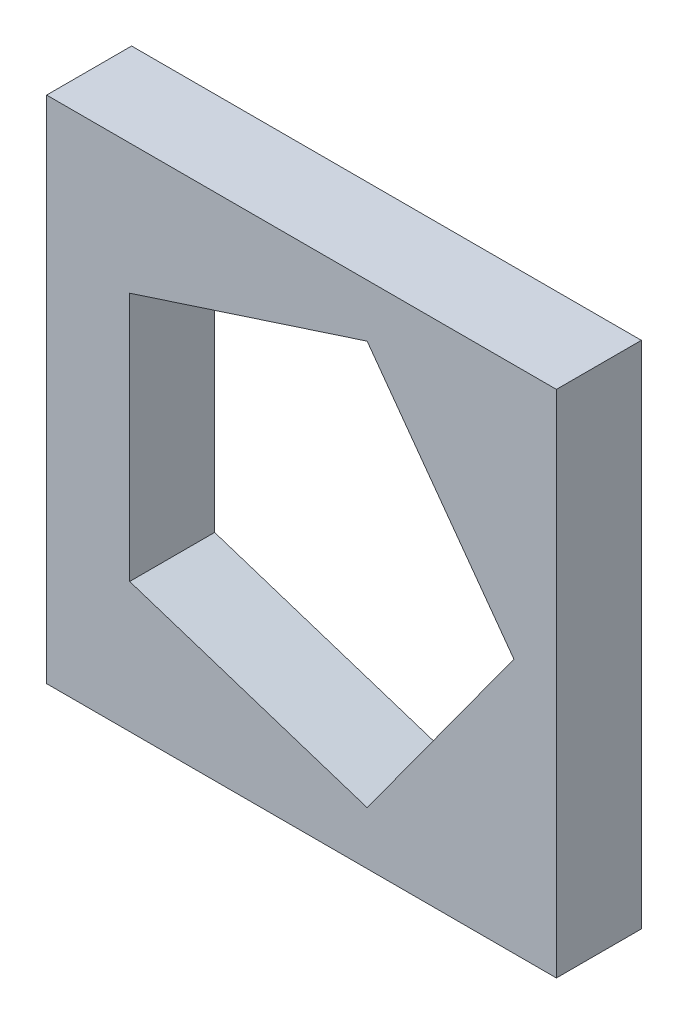
ISO-10303-21;
HEADER;
FILE_DESCRIPTION(('STEP AP214'),'2;1');
FILE_NAME('part.step','',(''),(''),'','','');
FILE_SCHEMA(('AUTOMOTIVE_DESIGN { 1 0 10303 214 1 1 1 1 }'));
ENDSEC;
DATA;
#1=APPLICATION_CONTEXT('core data for automotive mechanical design processes');
#2=APPLICATION_PROTOCOL_DEFINITION('international standard','automotive_design',2000,#1);
#3=PRODUCT_CONTEXT('',#1,'mechanical');
#4=PRODUCT('Part','Part','',(#3));
#5=PRODUCT_RELATED_PRODUCT_CATEGORY('part','',(#4));
#6=PRODUCT_DEFINITION_FORMATION('','',#4);
#7=PRODUCT_DEFINITION_CONTEXT('part definition',#1,'design');
#8=PRODUCT_DEFINITION('design','',#6,#7);
#9=PRODUCT_DEFINITION_SHAPE('','',#8);
#10=(LENGTH_UNIT() NAMED_UNIT(*) SI_UNIT(.MILLI.,.METRE.));
#11=(NAMED_UNIT(*) PLANE_ANGLE_UNIT() SI_UNIT($,.RADIAN.));
#12=(NAMED_UNIT(*) SI_UNIT($,.STERADIAN.) SOLID_ANGLE_UNIT());
#13=UNCERTAINTY_MEASURE_WITH_UNIT(LENGTH_MEASURE(1.E-05),#10,'distance_accuracy_value','');
#14=(GEOMETRIC_REPRESENTATION_CONTEXT(3) GLOBAL_UNCERTAINTY_ASSIGNED_CONTEXT((#13)) GLOBAL_UNIT_ASSIGNED_CONTEXT((#10,
#11,#12)) REPRESENTATION_CONTEXT('',''));
#15=CARTESIAN_POINT('',(0.,0.,0.));
#16=DIRECTION('',(0.,0.,1.));
#17=DIRECTION('',(1.,0.,0.));
#18=AXIS2_PLACEMENT_3D('',#15,#16,#17);
#19=CARTESIAN_POINT('',(0.,0.,10.));
#20=DIRECTION('',(0.,0.,1.));
#21=DIRECTION('',(1.,0.,0.));
#22=AXIS2_PLACEMENT_3D('',#19,#20,#21);
#23=PLANE('',#22);
#24=DIRECTION('',(0.,-1.,0.));
#25=VECTOR('',#24,1.);
#26=CARTESIAN_POINT('',(-30.,30.,10.));
#27=LINE('',#26,#25);
#28=CARTESIAN_POINT('',(-30.,30.,10.));
#29=VERTEX_POINT('',#28);
#30=CARTESIAN_POINT('',(-30.,-30.,10.));
#31=VERTEX_POINT('',#30);
#32=EDGE_CURVE('E175',#29,#31,#27,.T.);
#33=ORIENTED_EDGE('',*,*,#32,.T.);
#34=DIRECTION('',(1.,0.,0.));
#35=VECTOR('',#34,1.);
#36=CARTESIAN_POINT('',(-30.,-30.,10.));
#37=LINE('',#36,#35);
#38=CARTESIAN_POINT('',(30.,-30.,10.));
#39=VERTEX_POINT('',#38);
#40=EDGE_CURVE('E178',#31,#39,#37,.T.);
#41=ORIENTED_EDGE('',*,*,#40,.T.);
#42=DIRECTION('',(0.,-1.,0.));
#43=VECTOR('',#42,1.);
#44=CARTESIAN_POINT('',(30.,30.,10.));
#45=LINE('',#44,#43);
#46=CARTESIAN_POINT('',(30.,30.,10.));
#47=VERTEX_POINT('',#46);
#48=EDGE_CURVE('E181',#47,#39,#45,.T.);
#49=ORIENTED_EDGE('',*,*,#48,.F.);
#50=DIRECTION('',(1.,0.,0.));
#51=VECTOR('',#50,1.);
#52=CARTESIAN_POINT('',(-30.,30.,10.));
#53=LINE('',#52,#51);
#54=EDGE_CURVE('E184',#29,#47,#53,.T.);
#55=ORIENTED_EDGE('',*,*,#54,.F.);
#56=EDGE_LOOP('',(#33,#41,#49,#55));
#57=FACE_BOUND('',#56,.T.);
#58=DIRECTION('',(-0.587785252292473,0.809016994374947,0.));
#59=VECTOR('',#58,1.);
#60=CARTESIAN_POINT('',(25.,0.,10.));
#61=LINE('',#60,#59);
#62=CARTESIAN_POINT('',(25.,0.,10.));
#63=VERTEX_POINT('',#62);
#64=CARTESIAN_POINT('',(7.72542485937369,23.7764129073789,10.));
#65=VERTEX_POINT('',#64);
#66=EDGE_CURVE('E139',#63,#65,#61,.T.);
#67=ORIENTED_EDGE('',*,*,#66,.F.);
#68=DIRECTION('',(0.587785252292473,0.809016994374947,0.));
#69=VECTOR('',#68,1.);
#70=CARTESIAN_POINT('',(7.72542485937368,-23.7764129073789,10.));
#71=LINE('',#70,#69);
#72=CARTESIAN_POINT('',(7.72542485937368,-23.7764129073789,10.));
#73=VERTEX_POINT('',#72);
#74=EDGE_CURVE('E131',#73,#63,#71,.T.);
#75=ORIENTED_EDGE('',*,*,#74,.F.);
#76=DIRECTION('',(0.951056516295154,-0.309016994374948,0.));
#77=VECTOR('',#76,1.);
#78=CARTESIAN_POINT('',(-20.2254248593737,-14.6946313073118,10.));
#79=LINE('',#78,#77);
#80=CARTESIAN_POINT('',(-20.2254248593737,-14.6946313073118,10.));
#81=VERTEX_POINT('',#80);
#82=EDGE_CURVE('E158',#81,#73,#79,.T.);
#83=ORIENTED_EDGE('',*,*,#82,.F.);
#84=DIRECTION('',(0.,-1.,0.));
#85=VECTOR('',#84,1.);
#86=CARTESIAN_POINT('',(-20.2254248593737,14.6946313073118,10.));
#87=LINE('',#86,#85);
#88=CARTESIAN_POINT('',(-20.2254248593737,14.6946313073118,10.));
#89=VERTEX_POINT('',#88);
#90=EDGE_CURVE('E154',#89,#81,#87,.T.);
#91=ORIENTED_EDGE('',*,*,#90,.F.);
#92=DIRECTION('',(-0.951056516295154,-0.309016994374947,0.));
#93=VECTOR('',#92,1.);
#94=CARTESIAN_POINT('',(7.72542485937369,23.7764129073789,10.));
#95=LINE('',#94,#93);
#96=EDGE_CURVE('E152',#65,#89,#95,.T.);
#97=ORIENTED_EDGE('',*,*,#96,.F.);
#98=EDGE_LOOP('',(#67,#75,#83,#91,#97));
#99=FACE_BOUND('',#98,.T.);
#100=ADVANCED_FACE('F60',(#57,#99),#23,.T.);
#101=CARTESIAN_POINT('',(0.,0.,0.));
#102=DIRECTION('',(0.,0.,1.));
#103=DIRECTION('',(1.,0.,0.));
#104=AXIS2_PLACEMENT_3D('',#101,#102,#103);
#105=PLANE('',#104);
#106=DIRECTION('',(0.,-1.,0.));
#107=VECTOR('',#106,1.);
#108=CARTESIAN_POINT('',(-30.,30.,0.));
#109=LINE('',#108,#107);
#110=CARTESIAN_POINT('',(-30.,30.,0.));
#111=VERTEX_POINT('',#110);
#112=CARTESIAN_POINT('',(-30.,-30.,0.));
#113=VERTEX_POINT('',#112);
#114=EDGE_CURVE('E147',#111,#113,#109,.T.);
#115=ORIENTED_EDGE('',*,*,#114,.F.);
#116=DIRECTION('',(1.,0.,0.));
#117=VECTOR('',#116,1.);
#118=CARTESIAN_POINT('',(-30.,30.,0.));
#119=LINE('',#118,#117);
#120=CARTESIAN_POINT('',(30.,30.,0.));
#121=VERTEX_POINT('',#120);
#122=EDGE_CURVE('E179',#111,#121,#119,.T.);
#123=ORIENTED_EDGE('',*,*,#122,.T.);
#124=DIRECTION('',(0.,-1.,0.));
#125=VECTOR('',#124,1.);
#126=CARTESIAN_POINT('',(30.,30.,0.));
#127=LINE('',#126,#125);
#128=CARTESIAN_POINT('',(30.,-30.,0.));
#129=VERTEX_POINT('',#128);
#130=EDGE_CURVE('E193',#121,#129,#127,.T.);
#131=ORIENTED_EDGE('',*,*,#130,.T.);
#132=DIRECTION('',(1.,0.,0.));
#133=VECTOR('',#132,1.);
#134=CARTESIAN_POINT('',(-30.,-30.,0.));
#135=LINE('',#134,#133);
#136=EDGE_CURVE('E190',#113,#129,#135,.T.);
#137=ORIENTED_EDGE('',*,*,#136,.F.);
#138=EDGE_LOOP('',(#115,#123,#131,#137));
#139=FACE_BOUND('',#138,.T.);
#140=DIRECTION('',(0.587785252292473,0.809016994374947,0.));
#141=VECTOR('',#140,1.);
#142=CARTESIAN_POINT('',(7.72542485937368,-23.7764129073789,0.));
#143=LINE('',#142,#141);
#144=CARTESIAN_POINT('',(7.72542485937368,-23.7764129073789,0.));
#145=VERTEX_POINT('',#144);
#146=CARTESIAN_POINT('',(25.,0.,0.));
#147=VERTEX_POINT('',#146);
#148=EDGE_CURVE('E83',#145,#147,#143,.T.);
#149=ORIENTED_EDGE('',*,*,#148,.T.);
#150=DIRECTION('',(-0.587785252292473,0.809016994374947,0.));
#151=VECTOR('',#150,1.);
#152=CARTESIAN_POINT('',(25.,0.,0.));
#153=LINE('',#152,#151);
#154=CARTESIAN_POINT('',(7.72542485937369,23.7764129073789,0.));
#155=VERTEX_POINT('',#154);
#156=EDGE_CURVE('E146',#147,#155,#153,.T.);
#157=ORIENTED_EDGE('',*,*,#156,.T.);
#158=DIRECTION('',(-0.951056516295154,-0.309016994374947,0.));
#159=VECTOR('',#158,1.);
#160=CARTESIAN_POINT('',(7.72542485937369,23.7764129073789,0.));
#161=LINE('',#160,#159);
#162=CARTESIAN_POINT('',(-20.2254248593737,14.6946313073118,0.));
#163=VERTEX_POINT('',#162);
#164=EDGE_CURVE('E162',#155,#163,#161,.T.);
#165=ORIENTED_EDGE('',*,*,#164,.T.);
#166=DIRECTION('',(0.,-1.,0.));
#167=VECTOR('',#166,1.);
#168=CARTESIAN_POINT('',(-20.2254248593737,14.6946313073118,0.));
#169=LINE('',#168,#167);
#170=CARTESIAN_POINT('',(-20.2254248593737,-14.6946313073118,0.));
#171=VERTEX_POINT('',#170);
#172=EDGE_CURVE('E165',#163,#171,#169,.T.);
#173=ORIENTED_EDGE('',*,*,#172,.T.);
#174=DIRECTION('',(0.951056516295154,-0.309016994374948,0.));
#175=VECTOR('',#174,1.);
#176=CARTESIAN_POINT('',(-20.2254248593737,-14.6946313073118,0.));
#177=LINE('',#176,#175);
#178=EDGE_CURVE('E140',#171,#145,#177,.T.);
#179=ORIENTED_EDGE('',*,*,#178,.T.);
#180=EDGE_LOOP('',(#149,#157,#165,#173,#179));
#181=FACE_BOUND('',#180,.T.);
#182=ADVANCED_FACE('F210',(#139,#181),#105,.F.);
#183=CARTESIAN_POINT('',(-30.,30.,10.));
#184=DIRECTION('',(1.,0.,0.));
#185=DIRECTION('',(0.,1.,0.));
#186=AXIS2_PLACEMENT_3D('',#183,#184,#185);
#187=PLANE('',#186);
#188=ORIENTED_EDGE('',*,*,#114,.T.);
#189=DIRECTION('',(0.,0.,-1.));
#190=VECTOR('',#189,1.);
#191=CARTESIAN_POINT('',(-30.,-30.,10.));
#192=LINE('',#191,#190);
#193=EDGE_CURVE('E12',#31,#113,#192,.T.);
#194=ORIENTED_EDGE('',*,*,#193,.F.);
#195=ORIENTED_EDGE('',*,*,#32,.F.);
#196=DIRECTION('',(0.,0.,-1.));
#197=VECTOR('',#196,1.);
#198=CARTESIAN_POINT('',(-30.,30.,10.));
#199=LINE('',#198,#197);
#200=EDGE_CURVE('E187',#29,#111,#199,.T.);
#201=ORIENTED_EDGE('',*,*,#200,.T.);
#202=EDGE_LOOP('',(#188,#194,#195,#201));
#203=FACE_BOUND('',#202,.T.);
#204=ADVANCED_FACE('F62',(#203),#187,.F.);
#205=CARTESIAN_POINT('',(-30.,-30.,10.));
#206=DIRECTION('',(0.,1.,0.));
#207=DIRECTION('',(0.,0.,1.));
#208=AXIS2_PLACEMENT_3D('',#205,#206,#207);
#209=PLANE('',#208);
#210=ORIENTED_EDGE('',*,*,#136,.T.);
#211=DIRECTION('',(0.,0.,-1.));
#212=VECTOR('',#211,1.);
#213=CARTESIAN_POINT('',(30.,-30.,10.));
#214=LINE('',#213,#212);
#215=EDGE_CURVE('E68',#39,#129,#214,.T.);
#216=ORIENTED_EDGE('',*,*,#215,.F.);
#217=ORIENTED_EDGE('',*,*,#40,.F.);
#218=ORIENTED_EDGE('',*,*,#193,.T.);
#219=EDGE_LOOP('',(#210,#216,#217,#218));
#220=FACE_BOUND('',#219,.T.);
#221=ADVANCED_FACE('F206',(#220),#209,.F.);
#222=CARTESIAN_POINT('',(30.,30.,10.));
#223=DIRECTION('',(1.,0.,0.));
#224=DIRECTION('',(0.,0.,-1.));
#225=AXIS2_PLACEMENT_3D('',#222,#223,#224);
#226=PLANE('',#225);
#227=ORIENTED_EDGE('',*,*,#130,.F.);
#228=DIRECTION('',(0.,0.,-1.));
#229=VECTOR('',#228,1.);
#230=CARTESIAN_POINT('',(30.,30.,10.));
#231=LINE('',#230,#229);
#232=EDGE_CURVE('E199',#47,#121,#231,.T.);
#233=ORIENTED_EDGE('',*,*,#232,.F.);
#234=ORIENTED_EDGE('',*,*,#48,.T.);
#235=ORIENTED_EDGE('',*,*,#215,.T.);
#236=EDGE_LOOP('',(#227,#233,#234,#235));
#237=FACE_BOUND('',#236,.T.);
#238=ADVANCED_FACE('F203',(#237),#226,.T.);
#239=CARTESIAN_POINT('',(-30.,30.,10.));
#240=DIRECTION('',(0.,1.,0.));
#241=DIRECTION('',(0.,0.,1.));
#242=AXIS2_PLACEMENT_3D('',#239,#240,#241);
#243=PLANE('',#242);
#244=ORIENTED_EDGE('',*,*,#122,.F.);
#245=ORIENTED_EDGE('',*,*,#200,.F.);
#246=ORIENTED_EDGE('',*,*,#54,.T.);
#247=ORIENTED_EDGE('',*,*,#232,.T.);
#248=EDGE_LOOP('',(#244,#245,#246,#247));
#249=FACE_BOUND('',#248,.T.);
#250=ADVANCED_FACE('F214',(#249),#243,.T.);
#251=CARTESIAN_POINT('',(7.72542485937368,-23.7764129073789,10.));
#252=DIRECTION('',(-0.809016994374947,0.587785252292473,0.));
#253=DIRECTION('',(-0.587785252292473,-0.809016994374947,0.));
#254=AXIS2_PLACEMENT_3D('',#251,#252,#253);
#255=PLANE('',#254);
#256=ORIENTED_EDGE('',*,*,#148,.F.);
#257=DIRECTION('',(0.,0.,-1.));
#258=VECTOR('',#257,1.);
#259=CARTESIAN_POINT('',(7.72542485937368,-23.7764129073789,10.));
#260=LINE('',#259,#258);
#261=EDGE_CURVE('E135',#73,#145,#260,.T.);
#262=ORIENTED_EDGE('',*,*,#261,.F.);
#263=ORIENTED_EDGE('',*,*,#74,.T.);
#264=DIRECTION('',(0.,0.,-1.));
#265=VECTOR('',#264,1.);
#266=CARTESIAN_POINT('',(25.,0.,10.));
#267=LINE('',#266,#265);
#268=EDGE_CURVE('E134',#63,#147,#267,.T.);
#269=ORIENTED_EDGE('',*,*,#268,.T.);
#270=EDGE_LOOP('',(#256,#262,#263,#269));
#271=FACE_BOUND('',#270,.T.);
#272=ADVANCED_FACE('F133',(#271),#255,.T.);
#273=CARTESIAN_POINT('',(25.,0.,10.));
#274=DIRECTION('',(-0.809016994374947,-0.587785252292473,0.));
#275=DIRECTION('',(0.587785252292473,-0.809016994374948,0.));
#276=AXIS2_PLACEMENT_3D('',#273,#274,#275);
#277=PLANE('',#276);
#278=ORIENTED_EDGE('',*,*,#156,.F.);
#279=ORIENTED_EDGE('',*,*,#268,.F.);
#280=ORIENTED_EDGE('',*,*,#66,.T.);
#281=DIRECTION('',(0.,0.,-1.));
#282=VECTOR('',#281,1.);
#283=CARTESIAN_POINT('',(7.72542485937369,23.7764129073789,10.));
#284=LINE('',#283,#282);
#285=EDGE_CURVE('E148',#65,#155,#284,.T.);
#286=ORIENTED_EDGE('',*,*,#285,.T.);
#287=EDGE_LOOP('',(#278,#279,#280,#286));
#288=FACE_BOUND('',#287,.T.);
#289=ADVANCED_FACE('F143',(#288),#277,.T.);
#290=CARTESIAN_POINT('',(7.72542485937369,23.7764129073789,10.));
#291=DIRECTION('',(0.309016994374947,-0.951056516295154,0.));
#292=DIRECTION('',(0.951056516295154,0.309016994374947,0.));
#293=AXIS2_PLACEMENT_3D('',#290,#291,#292);
#294=PLANE('',#293);
#295=ORIENTED_EDGE('',*,*,#164,.F.);
#296=ORIENTED_EDGE('',*,*,#285,.F.);
#297=ORIENTED_EDGE('',*,*,#96,.T.);
#298=DIRECTION('',(0.,0.,-1.));
#299=VECTOR('',#298,1.);
#300=CARTESIAN_POINT('',(-20.2254248593737,14.6946313073118,10.));
#301=LINE('',#300,#299);
#302=EDGE_CURVE('E172',#89,#163,#301,.T.);
#303=ORIENTED_EDGE('',*,*,#302,.T.);
#304=EDGE_LOOP('',(#295,#296,#297,#303));
#305=FACE_BOUND('',#304,.T.);
#306=ADVANCED_FACE('F254',(#305),#294,.T.);
#307=CARTESIAN_POINT('',(-20.2254248593737,14.6946313073118,10.));
#308=DIRECTION('',(1.,0.,0.));
#309=DIRECTION('',(0.,0.,-1.));
#310=AXIS2_PLACEMENT_3D('',#307,#308,#309);
#311=PLANE('',#310);
#312=ORIENTED_EDGE('',*,*,#172,.F.);
#313=ORIENTED_EDGE('',*,*,#302,.F.);
#314=ORIENTED_EDGE('',*,*,#90,.T.);
#315=DIRECTION('',(0.,0.,-1.));
#316=VECTOR('',#315,1.);
#317=CARTESIAN_POINT('',(-20.2254248593737,-14.6946313073118,10.));
#318=LINE('',#317,#316);
#319=EDGE_CURVE('E75',#81,#171,#318,.T.);
#320=ORIENTED_EDGE('',*,*,#319,.T.);
#321=EDGE_LOOP('',(#312,#313,#314,#320));
#322=FACE_BOUND('',#321,.T.);
#323=ADVANCED_FACE('F260',(#322),#311,.T.);
#324=CARTESIAN_POINT('',(-20.2254248593737,-14.6946313073118,10.));
#325=DIRECTION('',(0.309016994374948,0.951056516295154,0.));
#326=DIRECTION('',(-0.951056516295154,0.309016994374948,0.));
#327=AXIS2_PLACEMENT_3D('',#324,#325,#326);
#328=PLANE('',#327);
#329=ORIENTED_EDGE('',*,*,#178,.F.);
#330=ORIENTED_EDGE('',*,*,#319,.F.);
#331=ORIENTED_EDGE('',*,*,#82,.T.);
#332=ORIENTED_EDGE('',*,*,#261,.T.);
#333=EDGE_LOOP('',(#329,#330,#331,#332));
#334=FACE_BOUND('',#333,.T.);
#335=ADVANCED_FACE('F268',(#334),#328,.T.);
#336=CLOSED_SHELL('',(#100,#182,#204,#221,#238,#250,#272,#289,#306,#323,#335));
#337=MANIFOLD_SOLID_BREP('B2',#336);
#338=ADVANCED_BREP_SHAPE_REPRESENTATION('',(#18,#337),#14);
#339=SHAPE_DEFINITION_REPRESENTATION(#9,#338);
ENDSEC;
END-ISO-10303-21;
